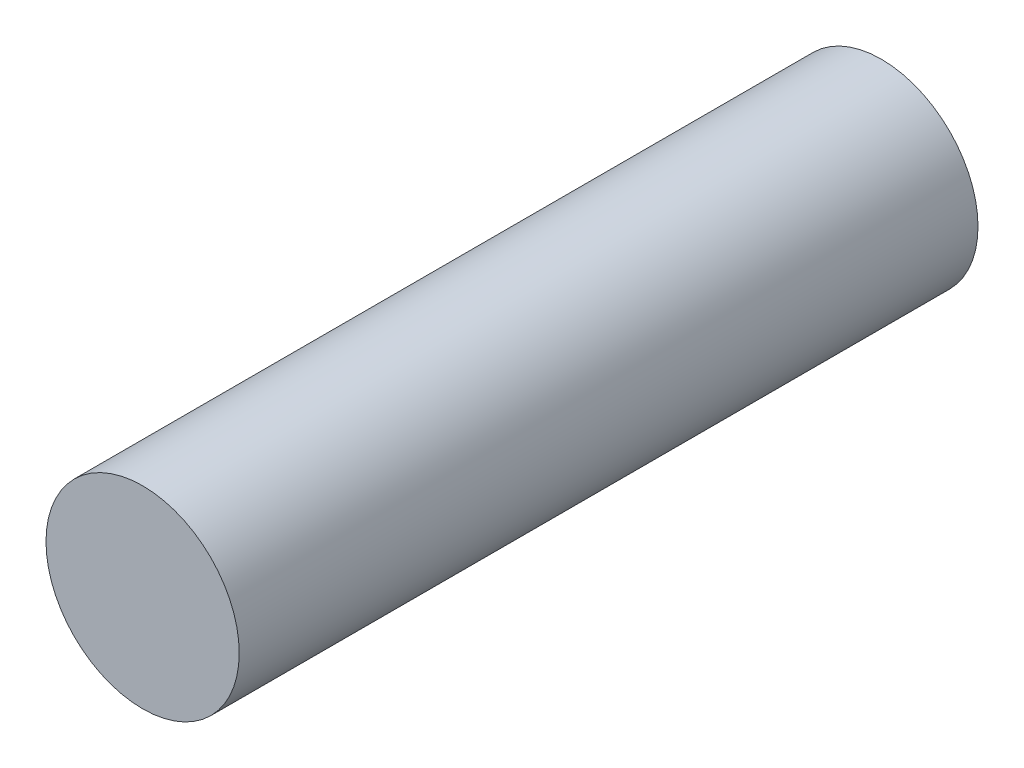
ISO-10303-21;
HEADER;
FILE_DESCRIPTION(('STEP AP214'),'2;1');
FILE_NAME('part.step','',(''),(''),'','','');
FILE_SCHEMA(('AUTOMOTIVE_DESIGN { 1 0 10303 214 1 1 1 1 }'));
ENDSEC;
DATA;
#1=APPLICATION_CONTEXT('core data for automotive mechanical design processes');
#2=APPLICATION_PROTOCOL_DEFINITION('international standard','automotive_design',2000,#1);
#3=PRODUCT_CONTEXT('',#1,'mechanical');
#4=PRODUCT('Part','Part','',(#3));
#5=PRODUCT_RELATED_PRODUCT_CATEGORY('part','',(#4));
#6=PRODUCT_DEFINITION_FORMATION('','',#4);
#7=PRODUCT_DEFINITION_CONTEXT('part definition',#1,'design');
#8=PRODUCT_DEFINITION('design','',#6,#7);
#9=PRODUCT_DEFINITION_SHAPE('','',#8);
#10=(LENGTH_UNIT() NAMED_UNIT(*) SI_UNIT(.MILLI.,.METRE.));
#11=(NAMED_UNIT(*) PLANE_ANGLE_UNIT() SI_UNIT($,.RADIAN.));
#12=(NAMED_UNIT(*) SI_UNIT($,.STERADIAN.) SOLID_ANGLE_UNIT());
#13=UNCERTAINTY_MEASURE_WITH_UNIT(LENGTH_MEASURE(1.E-05),#10,'distance_accuracy_value','');
#14=(GEOMETRIC_REPRESENTATION_CONTEXT(3) GLOBAL_UNCERTAINTY_ASSIGNED_CONTEXT((#13)) GLOBAL_UNIT_ASSIGNED_CONTEXT((#10,
#11,#12)) REPRESENTATION_CONTEXT('',''));
#15=CARTESIAN_POINT('',(0.,0.,0.));
#16=DIRECTION('',(0.,0.,1.));
#17=DIRECTION('',(1.,0.,0.));
#18=AXIS2_PLACEMENT_3D('',#15,#16,#17);
#19=CARTESIAN_POINT('',(0.,0.,65.));
#20=DIRECTION('',(0.,0.,-1.));
#21=DIRECTION('',(-1.,0.,0.));
#22=AXIS2_PLACEMENT_3D('',#19,#20,#21);
#23=CYLINDRICAL_SURFACE('',#22,8.5);
#24=CARTESIAN_POINT('',(0.,0.,65.));
#25=DIRECTION('',(0.,0.,1.));
#26=DIRECTION('',(1.,0.,0.));
#27=AXIS2_PLACEMENT_3D('',#24,#25,#26);
#28=CIRCLE('',#27,8.5);
#29=CARTESIAN_POINT('',(8.5,0.,65.));
#30=VERTEX_POINT('',#29);
#31=EDGE_CURVE('E10',#30,#30,#28,.T.);
#32=ORIENTED_EDGE('',*,*,#31,.F.);
#33=EDGE_LOOP('',(#32));
#34=FACE_BOUND('',#33,.T.);
#35=CARTESIAN_POINT('',(0.,0.,0.));
#36=DIRECTION('',(0.,0.,1.));
#37=DIRECTION('',(1.,0.,0.));
#38=AXIS2_PLACEMENT_3D('',#35,#36,#37);
#39=CIRCLE('',#38,8.5);
#40=CARTESIAN_POINT('',(8.5,0.,0.));
#41=VERTEX_POINT('',#40);
#42=EDGE_CURVE('E40',#41,#41,#39,.T.);
#43=ORIENTED_EDGE('',*,*,#42,.T.);
#44=EDGE_LOOP('',(#43));
#45=FACE_BOUND('',#44,.T.);
#46=ADVANCED_FACE('F37',(#34,#45),#23,.T.);
#47=CARTESIAN_POINT('',(0.,0.,65.));
#48=DIRECTION('',(0.,0.,1.));
#49=DIRECTION('',(1.,0.,0.));
#50=AXIS2_PLACEMENT_3D('',#47,#48,#49);
#51=PLANE('',#50);
#52=ORIENTED_EDGE('',*,*,#31,.T.);
#53=EDGE_LOOP('',(#52));
#54=FACE_BOUND('',#53,.T.);
#55=ADVANCED_FACE('F54',(#54),#51,.T.);
#56=CARTESIAN_POINT('',(0.,0.,0.));
#57=DIRECTION('',(0.,0.,1.));
#58=DIRECTION('',(1.,0.,0.));
#59=AXIS2_PLACEMENT_3D('',#56,#57,#58);
#60=PLANE('',#59);
#61=ORIENTED_EDGE('',*,*,#42,.F.);
#62=EDGE_LOOP('',(#61));
#63=FACE_BOUND('',#62,.T.);
#64=ADVANCED_FACE('F52',(#63),#60,.F.);
#65=CLOSED_SHELL('',(#46,#55,#64));
#66=MANIFOLD_SOLID_BREP('B2',#65);
#67=ADVANCED_BREP_SHAPE_REPRESENTATION('',(#18,#66),#14);
#68=SHAPE_DEFINITION_REPRESENTATION(#9,#67);
ENDSEC;
END-ISO-10303-21;
